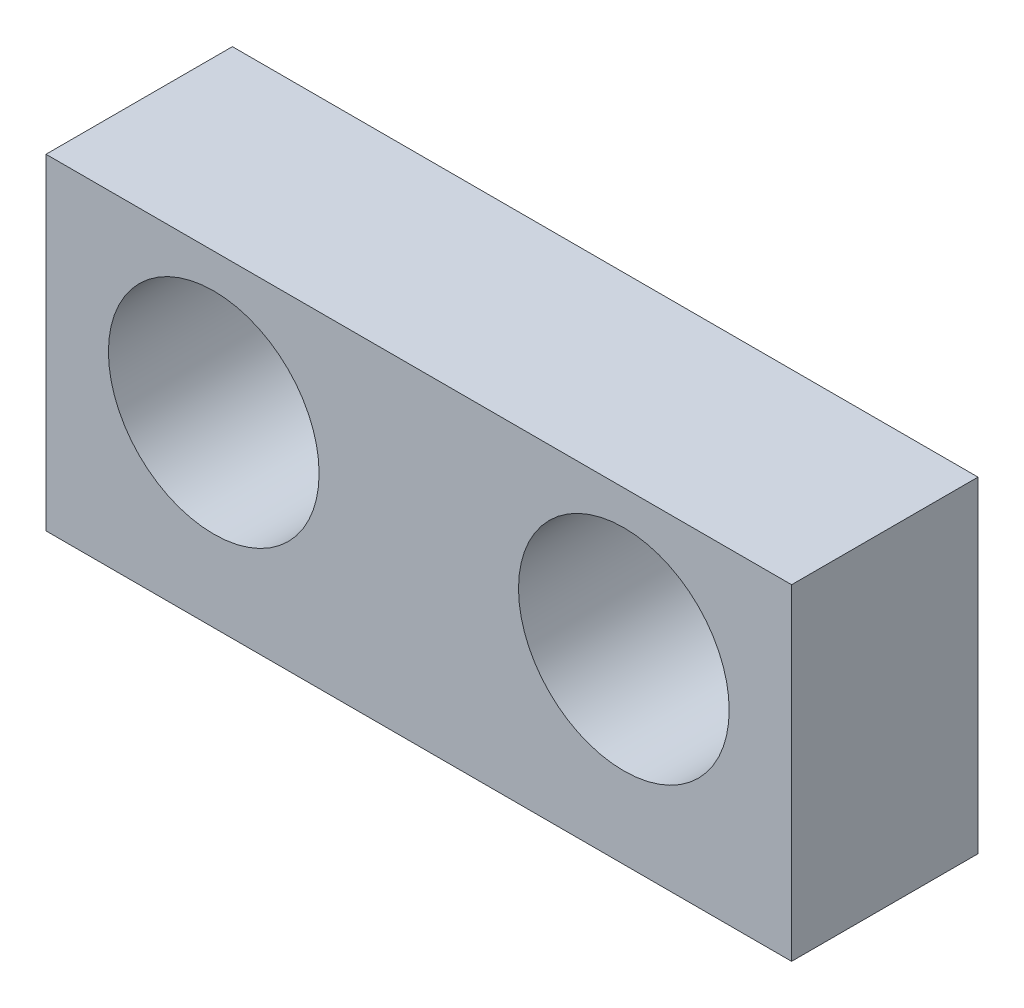
ISO-10303-21;
HEADER;
FILE_DESCRIPTION(('STEP AP214'),'2;1');
FILE_NAME('part.step','',(''),(''),'','','');
FILE_SCHEMA(('AUTOMOTIVE_DESIGN { 1 0 10303 214 1 1 1 1 }'));
ENDSEC;
DATA;
#1=APPLICATION_CONTEXT('core data for automotive mechanical design processes');
#2=APPLICATION_PROTOCOL_DEFINITION('international standard','automotive_design',2000,#1);
#3=PRODUCT_CONTEXT('',#1,'mechanical');
#4=PRODUCT('Part','Part','',(#3));
#5=PRODUCT_RELATED_PRODUCT_CATEGORY('part','',(#4));
#6=PRODUCT_DEFINITION_FORMATION('','',#4);
#7=PRODUCT_DEFINITION_CONTEXT('part definition',#1,'design');
#8=PRODUCT_DEFINITION('design','',#6,#7);
#9=PRODUCT_DEFINITION_SHAPE('','',#8);
#10=(LENGTH_UNIT() NAMED_UNIT(*) SI_UNIT(.MILLI.,.METRE.));
#11=(NAMED_UNIT(*) PLANE_ANGLE_UNIT() SI_UNIT($,.RADIAN.));
#12=(NAMED_UNIT(*) SI_UNIT($,.STERADIAN.) SOLID_ANGLE_UNIT());
#13=UNCERTAINTY_MEASURE_WITH_UNIT(LENGTH_MEASURE(1.E-05),#10,'distance_accuracy_value','');
#14=(GEOMETRIC_REPRESENTATION_CONTEXT(3) GLOBAL_UNCERTAINTY_ASSIGNED_CONTEXT((#13)) GLOBAL_UNIT_ASSIGNED_CONTEXT((#10,
#11,#12)) REPRESENTATION_CONTEXT('',''));
#15=CARTESIAN_POINT('',(0.,0.,0.));
#16=DIRECTION('',(0.,0.,1.));
#17=DIRECTION('',(1.,0.,0.));
#18=AXIS2_PLACEMENT_3D('',#15,#16,#17);
#19=CARTESIAN_POINT('',(-4.,3.,-2.));
#20=DIRECTION('',(-1.,0.,0.));
#21=DIRECTION('',(0.,-1.,0.));
#22=AXIS2_PLACEMENT_3D('',#19,#20,#21);
#23=PLANE('',#22);
#24=DIRECTION('',(0.,-1.,0.));
#25=VECTOR('',#24,1.);
#26=CARTESIAN_POINT('',(-4.,3.,0.));
#27=LINE('',#26,#25);
#28=CARTESIAN_POINT('',(-4.,3.,0.));
#29=VERTEX_POINT('',#28);
#30=CARTESIAN_POINT('',(-4.,-0.5,0.));
#31=VERTEX_POINT('',#30);
#32=EDGE_CURVE('E98',#29,#31,#27,.T.);
#33=ORIENTED_EDGE('',*,*,#32,.F.);
#34=DIRECTION('',(0.,0.,1.));
#35=VECTOR('',#34,1.);
#36=CARTESIAN_POINT('',(-4.,3.,-2.));
#37=LINE('',#36,#35);
#38=CARTESIAN_POINT('',(-4.,3.,-2.));
#39=VERTEX_POINT('',#38);
#40=EDGE_CURVE('E11',#39,#29,#37,.T.);
#41=ORIENTED_EDGE('',*,*,#40,.F.);
#42=DIRECTION('',(0.,-1.,0.));
#43=VECTOR('',#42,1.);
#44=CARTESIAN_POINT('',(-4.,3.,-2.));
#45=LINE('',#44,#43);
#46=CARTESIAN_POINT('',(-4.,-0.5,-2.));
#47=VERTEX_POINT('',#46);
#48=EDGE_CURVE('E91',#39,#47,#45,.T.);
#49=ORIENTED_EDGE('',*,*,#48,.T.);
#50=DIRECTION('',(0.,0.,1.));
#51=VECTOR('',#50,1.);
#52=CARTESIAN_POINT('',(-4.,-0.5,-2.));
#53=LINE('',#52,#51);
#54=EDGE_CURVE('E36',#47,#31,#53,.T.);
#55=ORIENTED_EDGE('',*,*,#54,.T.);
#56=EDGE_LOOP('',(#33,#41,#49,#55));
#57=FACE_BOUND('',#56,.T.);
#58=ADVANCED_FACE('F33',(#57),#23,.T.);
#59=CARTESIAN_POINT('',(-4.,3.,-2.));
#60=DIRECTION('',(0.,1.,0.));
#61=DIRECTION('',(0.,0.,1.));
#62=AXIS2_PLACEMENT_3D('',#59,#60,#61);
#63=PLANE('',#62);
#64=DIRECTION('',(-1.,0.,0.));
#65=VECTOR('',#64,1.);
#66=CARTESIAN_POINT('',(-4.,3.,0.));
#67=LINE('',#66,#65);
#68=CARTESIAN_POINT('',(4.,3.,0.));
#69=VERTEX_POINT('',#68);
#70=EDGE_CURVE('E93',#69,#29,#67,.T.);
#71=ORIENTED_EDGE('',*,*,#70,.F.);
#72=DIRECTION('',(0.,0.,1.));
#73=VECTOR('',#72,1.);
#74=CARTESIAN_POINT('',(4.,3.,-2.));
#75=LINE('',#74,#73);
#76=CARTESIAN_POINT('',(4.,3.,-2.));
#77=VERTEX_POINT('',#76);
#78=EDGE_CURVE('E42',#77,#69,#75,.T.);
#79=ORIENTED_EDGE('',*,*,#78,.F.);
#80=DIRECTION('',(-1.,0.,0.));
#81=VECTOR('',#80,1.);
#82=CARTESIAN_POINT('',(-4.,3.,-2.));
#83=LINE('',#82,#81);
#84=EDGE_CURVE('E88',#77,#39,#83,.T.);
#85=ORIENTED_EDGE('',*,*,#84,.T.);
#86=ORIENTED_EDGE('',*,*,#40,.T.);
#87=EDGE_LOOP('',(#71,#79,#85,#86));
#88=FACE_BOUND('',#87,.T.);
#89=ADVANCED_FACE('F109',(#88),#63,.T.);
#90=CARTESIAN_POINT('',(4.,3.,-2.));
#91=DIRECTION('',(1.,0.,0.));
#92=DIRECTION('',(0.,0.,-1.));
#93=AXIS2_PLACEMENT_3D('',#90,#91,#92);
#94=PLANE('',#93);
#95=DIRECTION('',(0.,1.,0.));
#96=VECTOR('',#95,1.);
#97=CARTESIAN_POINT('',(4.,3.,0.));
#98=LINE('',#97,#96);
#99=CARTESIAN_POINT('',(4.,-0.5,0.));
#100=VERTEX_POINT('',#99);
#101=EDGE_CURVE('E83',#100,#69,#98,.T.);
#102=ORIENTED_EDGE('',*,*,#101,.F.);
#103=DIRECTION('',(0.,0.,1.));
#104=VECTOR('',#103,1.);
#105=CARTESIAN_POINT('',(4.,-0.5,-2.));
#106=LINE('',#105,#104);
#107=CARTESIAN_POINT('',(4.,-0.5,-2.));
#108=VERTEX_POINT('',#107);
#109=EDGE_CURVE('E78',#108,#100,#106,.T.);
#110=ORIENTED_EDGE('',*,*,#109,.F.);
#111=DIRECTION('',(0.,1.,0.));
#112=VECTOR('',#111,1.);
#113=CARTESIAN_POINT('',(4.,3.,-2.));
#114=LINE('',#113,#112);
#115=EDGE_CURVE('E81',#108,#77,#114,.T.);
#116=ORIENTED_EDGE('',*,*,#115,.T.);
#117=ORIENTED_EDGE('',*,*,#78,.T.);
#118=EDGE_LOOP('',(#102,#110,#116,#117));
#119=FACE_BOUND('',#118,.T.);
#120=ADVANCED_FACE('F80',(#119),#94,.T.);
#121=CARTESIAN_POINT('',(-4.,-0.5,-2.));
#122=DIRECTION('',(0.,-1.,0.));
#123=DIRECTION('',(0.,0.,-1.));
#124=AXIS2_PLACEMENT_3D('',#121,#122,#123);
#125=PLANE('',#124);
#126=DIRECTION('',(1.,0.,0.));
#127=VECTOR('',#126,1.);
#128=CARTESIAN_POINT('',(-4.,-0.5,0.));
#129=LINE('',#128,#127);
#130=EDGE_CURVE('E101',#31,#100,#129,.T.);
#131=ORIENTED_EDGE('',*,*,#130,.F.);
#132=ORIENTED_EDGE('',*,*,#54,.F.);
#133=DIRECTION('',(1.,0.,0.));
#134=VECTOR('',#133,1.);
#135=CARTESIAN_POINT('',(-4.,-0.5,-2.));
#136=LINE('',#135,#134);
#137=EDGE_CURVE('E87',#47,#108,#136,.T.);
#138=ORIENTED_EDGE('',*,*,#137,.T.);
#139=ORIENTED_EDGE('',*,*,#109,.T.);
#140=EDGE_LOOP('',(#131,#132,#138,#139));
#141=FACE_BOUND('',#140,.T.);
#142=ADVANCED_FACE('F90',(#141),#125,.T.);
#143=CARTESIAN_POINT('',(-4.,-0.5,-2.));
#144=DIRECTION('',(0.,0.,1.));
#145=DIRECTION('',(1.,0.,0.));
#146=AXIS2_PLACEMENT_3D('',#143,#144,#145);
#147=PLANE('',#146);
#148=CARTESIAN_POINT('',(2.2,1.5,-2.));
#149=DIRECTION('',(0.,0.,1.));
#150=DIRECTION('',(1.,0.,0.));
#151=AXIS2_PLACEMENT_3D('',#148,#149,#150);
#152=CIRCLE('',#151,1.1303);
#153=CARTESIAN_POINT('',(3.3303,1.5,-2.));
#154=VERTEX_POINT('',#153);
#155=EDGE_CURVE('E142',#154,#154,#152,.T.);
#156=ORIENTED_EDGE('',*,*,#155,.T.);
#157=EDGE_LOOP('',(#156));
#158=FACE_BOUND('',#157,.T.);
#159=CARTESIAN_POINT('',(-2.2,1.5,-2.));
#160=DIRECTION('',(0.,0.,1.));
#161=DIRECTION('',(1.,0.,0.));
#162=AXIS2_PLACEMENT_3D('',#159,#160,#161);
#163=CIRCLE('',#162,1.1303);
#164=CARTESIAN_POINT('',(-1.0697,1.5,-2.));
#165=VERTEX_POINT('',#164);
#166=EDGE_CURVE('E102',#165,#165,#163,.T.);
#167=ORIENTED_EDGE('',*,*,#166,.T.);
#168=EDGE_LOOP('',(#167));
#169=FACE_BOUND('',#168,.T.);
#170=ORIENTED_EDGE('',*,*,#48,.F.);
#171=ORIENTED_EDGE('',*,*,#84,.F.);
#172=ORIENTED_EDGE('',*,*,#115,.F.);
#173=ORIENTED_EDGE('',*,*,#137,.F.);
#174=EDGE_LOOP('',(#170,#171,#172,#173));
#175=FACE_BOUND('',#174,.T.);
#176=ADVANCED_FACE('F86',(#158,#169,#175),#147,.F.);
#177=CARTESIAN_POINT('',(-4.,-0.5,0.));
#178=DIRECTION('',(0.,0.,1.));
#179=DIRECTION('',(1.,0.,0.));
#180=AXIS2_PLACEMENT_3D('',#177,#178,#179);
#181=PLANE('',#180);
#182=CARTESIAN_POINT('',(2.2,1.5,0.));
#183=DIRECTION('',(0.,0.,1.));
#184=DIRECTION('',(1.,0.,0.));
#185=AXIS2_PLACEMENT_3D('',#182,#183,#184);
#186=CIRCLE('',#185,1.1303);
#187=CARTESIAN_POINT('',(3.3303,1.5,0.));
#188=VERTEX_POINT('',#187);
#189=EDGE_CURVE('E145',#188,#188,#186,.T.);
#190=ORIENTED_EDGE('',*,*,#189,.F.);
#191=EDGE_LOOP('',(#190));
#192=FACE_BOUND('',#191,.T.);
#193=CARTESIAN_POINT('',(-2.2,1.5,0.));
#194=DIRECTION('',(0.,0.,1.));
#195=DIRECTION('',(1.,0.,0.));
#196=AXIS2_PLACEMENT_3D('',#193,#194,#195);
#197=CIRCLE('',#196,1.1303);
#198=CARTESIAN_POINT('',(-1.0697,1.5,0.));
#199=VERTEX_POINT('',#198);
#200=EDGE_CURVE('E147',#199,#199,#197,.T.);
#201=ORIENTED_EDGE('',*,*,#200,.F.);
#202=EDGE_LOOP('',(#201));
#203=FACE_BOUND('',#202,.T.);
#204=ORIENTED_EDGE('',*,*,#32,.T.);
#205=ORIENTED_EDGE('',*,*,#130,.T.);
#206=ORIENTED_EDGE('',*,*,#101,.T.);
#207=ORIENTED_EDGE('',*,*,#70,.T.);
#208=EDGE_LOOP('',(#204,#205,#206,#207));
#209=FACE_BOUND('',#208,.T.);
#210=ADVANCED_FACE('F108',(#192,#203,#209),#181,.T.);
#211=CARTESIAN_POINT('',(-2.2,1.5,-2.));
#212=DIRECTION('',(0.,0.,1.));
#213=DIRECTION('',(1.,0.,0.));
#214=AXIS2_PLACEMENT_3D('',#211,#212,#213);
#215=CYLINDRICAL_SURFACE('',#214,1.1303);
#216=ORIENTED_EDGE('',*,*,#166,.F.);
#217=EDGE_LOOP('',(#216));
#218=FACE_BOUND('',#217,.T.);
#219=ORIENTED_EDGE('',*,*,#200,.T.);
#220=EDGE_LOOP('',(#219));
#221=FACE_BOUND('',#220,.T.);
#222=ADVANCED_FACE('F127',(#218,#221),#215,.F.);
#223=CARTESIAN_POINT('',(2.2,1.5,-2.));
#224=DIRECTION('',(0.,0.,1.));
#225=DIRECTION('',(1.,0.,0.));
#226=AXIS2_PLACEMENT_3D('',#223,#224,#225);
#227=CYLINDRICAL_SURFACE('',#226,1.1303);
#228=ORIENTED_EDGE('',*,*,#155,.F.);
#229=EDGE_LOOP('',(#228));
#230=FACE_BOUND('',#229,.T.);
#231=ORIENTED_EDGE('',*,*,#189,.T.);
#232=EDGE_LOOP('',(#231));
#233=FACE_BOUND('',#232,.T.);
#234=ADVANCED_FACE('F134',(#230,#233),#227,.F.);
#235=CLOSED_SHELL('',(#58,#89,#120,#142,#176,#210,#222,#234));
#236=MANIFOLD_SOLID_BREP('B2',#235);
#237=ADVANCED_BREP_SHAPE_REPRESENTATION('',(#18,#236),#14);
#238=SHAPE_DEFINITION_REPRESENTATION(#9,#237);
ENDSEC;
END-ISO-10303-21;
